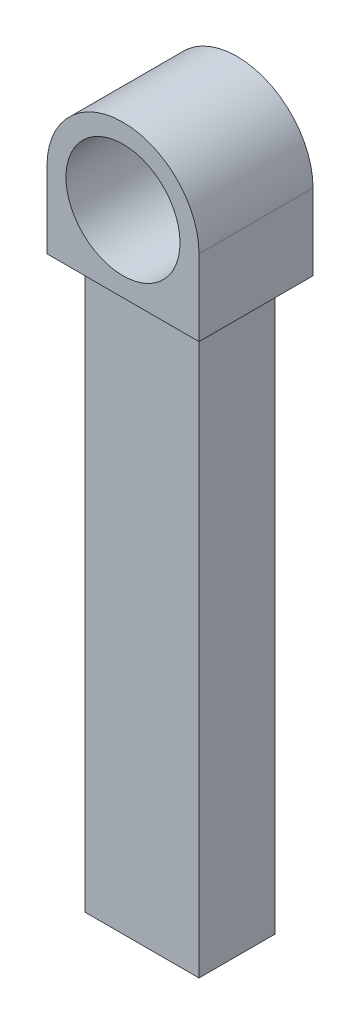
ISO-10303-21;
HEADER;
FILE_DESCRIPTION(('STEP AP214'),'2;1');
FILE_NAME('part.step','',(''),(''),'','','');
FILE_SCHEMA(('AUTOMOTIVE_DESIGN { 1 0 10303 214 1 1 1 1 }'));
ENDSEC;
DATA;
#1=APPLICATION_CONTEXT('core data for automotive mechanical design processes');
#2=APPLICATION_PROTOCOL_DEFINITION('international standard','automotive_design',2000,#1);
#3=PRODUCT_CONTEXT('',#1,'mechanical');
#4=PRODUCT('Part','Part','',(#3));
#5=PRODUCT_RELATED_PRODUCT_CATEGORY('part','',(#4));
#6=PRODUCT_DEFINITION_FORMATION('','',#4);
#7=PRODUCT_DEFINITION_CONTEXT('part definition',#1,'design');
#8=PRODUCT_DEFINITION('design','',#6,#7);
#9=PRODUCT_DEFINITION_SHAPE('','',#8);
#10=(LENGTH_UNIT() NAMED_UNIT(*) SI_UNIT(.MILLI.,.METRE.));
#11=(NAMED_UNIT(*) PLANE_ANGLE_UNIT() SI_UNIT($,.RADIAN.));
#12=(NAMED_UNIT(*) SI_UNIT($,.STERADIAN.) SOLID_ANGLE_UNIT());
#13=UNCERTAINTY_MEASURE_WITH_UNIT(LENGTH_MEASURE(1.E-05),#10,'distance_accuracy_value','');
#14=(GEOMETRIC_REPRESENTATION_CONTEXT(3) GLOBAL_UNCERTAINTY_ASSIGNED_CONTEXT((#13)) GLOBAL_UNIT_ASSIGNED_CONTEXT((#10,
#11,#12)) REPRESENTATION_CONTEXT('',''));
#15=CARTESIAN_POINT('',(0.,0.,0.));
#16=DIRECTION('',(0.,0.,1.));
#17=DIRECTION('',(1.,0.,0.));
#18=AXIS2_PLACEMENT_3D('',#15,#16,#17);
#19=CARTESIAN_POINT('',(0.,-2.,3.));
#20=DIRECTION('',(0.,1.,0.));
#21=DIRECTION('',(0.,0.,1.));
#22=AXIS2_PLACEMENT_3D('',#19,#20,#21);
#23=PLANE('',#22);
#24=DIRECTION('',(1.,0.,0.));
#25=VECTOR('',#24,1.);
#26=CARTESIAN_POINT('',(0.,-2.,0.));
#27=LINE('',#26,#25);
#28=CARTESIAN_POINT('',(-2.,-2.,0.));
#29=VERTEX_POINT('',#28);
#30=CARTESIAN_POINT('',(2.,-2.,0.));
#31=VERTEX_POINT('',#30);
#32=EDGE_CURVE('E120',#29,#31,#27,.T.);
#33=ORIENTED_EDGE('',*,*,#32,.T.);
#34=DIRECTION('',(0.,0.,-1.));
#35=VECTOR('',#34,1.);
#36=CARTESIAN_POINT('',(2.,-2.,3.));
#37=LINE('',#36,#35);
#38=CARTESIAN_POINT('',(2.,-2.,3.));
#39=VERTEX_POINT('',#38);
#40=EDGE_CURVE('E11',#39,#31,#37,.T.);
#41=ORIENTED_EDGE('',*,*,#40,.F.);
#42=DIRECTION('',(1.,0.,0.));
#43=VECTOR('',#42,1.);
#44=CARTESIAN_POINT('',(0.,-2.,3.));
#45=LINE('',#44,#43);
#46=CARTESIAN_POINT('',(-2.,-2.,3.));
#47=VERTEX_POINT('',#46);
#48=EDGE_CURVE('E129',#47,#39,#45,.T.);
#49=ORIENTED_EDGE('',*,*,#48,.F.);
#50=DIRECTION('',(0.,0.,-1.));
#51=VECTOR('',#50,1.);
#52=CARTESIAN_POINT('',(-2.,-2.,3.));
#53=LINE('',#52,#51);
#54=EDGE_CURVE('E141',#47,#29,#53,.T.);
#55=ORIENTED_EDGE('',*,*,#54,.T.);
#56=EDGE_LOOP('',(#33,#41,#49,#55));
#57=FACE_BOUND('',#56,.T.);
#58=DIRECTION('',(0.,0.,1.));
#59=VECTOR('',#58,1.);
#60=CARTESIAN_POINT('',(1.5,-2.,2.5));
#61=LINE('',#60,#59);
#62=CARTESIAN_POINT('',(1.5,-2.,0.5));
#63=VERTEX_POINT('',#62);
#64=CARTESIAN_POINT('',(1.5,-2.,2.5));
#65=VERTEX_POINT('',#64);
#66=EDGE_CURVE('E50',#63,#65,#61,.T.);
#67=ORIENTED_EDGE('',*,*,#66,.F.);
#68=DIRECTION('',(1.,0.,0.));
#69=VECTOR('',#68,1.);
#70=CARTESIAN_POINT('',(1.5,-2.,0.5));
#71=LINE('',#70,#69);
#72=CARTESIAN_POINT('',(-1.5,-2.,0.5));
#73=VERTEX_POINT('',#72);
#74=EDGE_CURVE('E54',#73,#63,#71,.T.);
#75=ORIENTED_EDGE('',*,*,#74,.F.);
#76=DIRECTION('',(0.,0.,-1.));
#77=VECTOR('',#76,1.);
#78=CARTESIAN_POINT('',(-1.5,-2.,2.5));
#79=LINE('',#78,#77);
#80=CARTESIAN_POINT('',(-1.5,-2.,2.5));
#81=VERTEX_POINT('',#80);
#82=EDGE_CURVE('E293',#81,#73,#79,.T.);
#83=ORIENTED_EDGE('',*,*,#82,.F.);
#84=DIRECTION('',(-1.,0.,0.));
#85=VECTOR('',#84,1.);
#86=CARTESIAN_POINT('',(1.5,-2.,2.5));
#87=LINE('',#86,#85);
#88=EDGE_CURVE('E299',#65,#81,#87,.T.);
#89=ORIENTED_EDGE('',*,*,#88,.F.);
#90=EDGE_LOOP('',(#67,#75,#83,#89));
#91=FACE_BOUND('',#90,.T.);
#92=ADVANCED_FACE('F36',(#57,#91),#23,.F.);
#93=CARTESIAN_POINT('',(2.,0.,3.));
#94=DIRECTION('',(-1.,0.,0.));
#95=DIRECTION('',(0.,-1.,0.));
#96=AXIS2_PLACEMENT_3D('',#93,#94,#95);
#97=PLANE('',#96);
#98=DIRECTION('',(0.,1.,0.));
#99=VECTOR('',#98,1.);
#100=CARTESIAN_POINT('',(2.,0.,0.));
#101=LINE('',#100,#99);
#102=CARTESIAN_POINT('',(2.,0.,0.));
#103=VERTEX_POINT('',#102);
#104=EDGE_CURVE('E123',#31,#103,#101,.T.);
#105=ORIENTED_EDGE('',*,*,#104,.T.);
#106=DIRECTION('',(0.,0.,-1.));
#107=VECTOR('',#106,1.);
#108=CARTESIAN_POINT('',(2.,0.,3.));
#109=LINE('',#108,#107);
#110=CARTESIAN_POINT('',(2.,0.,3.));
#111=VERTEX_POINT('',#110);
#112=EDGE_CURVE('E43',#111,#103,#109,.T.);
#113=ORIENTED_EDGE('',*,*,#112,.F.);
#114=DIRECTION('',(0.,1.,0.));
#115=VECTOR('',#114,1.);
#116=CARTESIAN_POINT('',(2.,0.,3.));
#117=LINE('',#116,#115);
#118=EDGE_CURVE('E132',#39,#111,#117,.T.);
#119=ORIENTED_EDGE('',*,*,#118,.F.);
#120=ORIENTED_EDGE('',*,*,#40,.T.);
#121=EDGE_LOOP('',(#105,#113,#119,#120));
#122=FACE_BOUND('',#121,.T.);
#123=ADVANCED_FACE('F177',(#122),#97,.F.);
#124=CARTESIAN_POINT('',(0.,0.,3.));
#125=DIRECTION('',(0.,0.,-1.));
#126=DIRECTION('',(-1.,0.,0.));
#127=AXIS2_PLACEMENT_3D('',#124,#125,#126);
#128=CYLINDRICAL_SURFACE('',#127,2.);
#129=CARTESIAN_POINT('',(0.,0.,0.));
#130=DIRECTION('',(0.,0.,1.));
#131=DIRECTION('',(1.,0.,0.));
#132=AXIS2_PLACEMENT_3D('',#129,#130,#131);
#133=CIRCLE('',#132,2.);
#134=CARTESIAN_POINT('',(-2.,0.,0.));
#135=VERTEX_POINT('',#134);
#136=EDGE_CURVE('E144',#103,#135,#133,.T.);
#137=ORIENTED_EDGE('',*,*,#136,.T.);
#138=DIRECTION('',(0.,0.,-1.));
#139=VECTOR('',#138,1.);
#140=CARTESIAN_POINT('',(-2.,0.,3.));
#141=LINE('',#140,#139);
#142=CARTESIAN_POINT('',(-2.,0.,3.));
#143=VERTEX_POINT('',#142);
#144=EDGE_CURVE('E152',#143,#135,#141,.T.);
#145=ORIENTED_EDGE('',*,*,#144,.F.);
#146=CARTESIAN_POINT('',(0.,0.,3.));
#147=DIRECTION('',(0.,0.,1.));
#148=DIRECTION('',(1.,0.,0.));
#149=AXIS2_PLACEMENT_3D('',#146,#147,#148);
#150=CIRCLE('',#149,2.);
#151=EDGE_CURVE('E135',#111,#143,#150,.T.);
#152=ORIENTED_EDGE('',*,*,#151,.F.);
#153=ORIENTED_EDGE('',*,*,#112,.T.);
#154=EDGE_LOOP('',(#137,#145,#152,#153));
#155=FACE_BOUND('',#154,.T.);
#156=ADVANCED_FACE('F159',(#155),#128,.T.);
#157=CARTESIAN_POINT('',(-2.,0.,3.));
#158=DIRECTION('',(1.,0.,0.));
#159=DIRECTION('',(0.,1.,0.));
#160=AXIS2_PLACEMENT_3D('',#157,#158,#159);
#161=PLANE('',#160);
#162=DIRECTION('',(0.,-1.,0.));
#163=VECTOR('',#162,1.);
#164=CARTESIAN_POINT('',(-2.,0.,0.));
#165=LINE('',#164,#163);
#166=EDGE_CURVE('E146',#135,#29,#165,.T.);
#167=ORIENTED_EDGE('',*,*,#166,.T.);
#168=ORIENTED_EDGE('',*,*,#54,.F.);
#169=DIRECTION('',(0.,-1.,0.));
#170=VECTOR('',#169,1.);
#171=CARTESIAN_POINT('',(-2.,0.,3.));
#172=LINE('',#171,#170);
#173=EDGE_CURVE('E137',#143,#47,#172,.T.);
#174=ORIENTED_EDGE('',*,*,#173,.F.);
#175=ORIENTED_EDGE('',*,*,#144,.T.);
#176=EDGE_LOOP('',(#167,#168,#174,#175));
#177=FACE_BOUND('',#176,.T.);
#178=ADVANCED_FACE('F169',(#177),#161,.F.);
#179=CARTESIAN_POINT('',(0.,0.,3.));
#180=DIRECTION('',(0.,0.,-1.));
#181=DIRECTION('',(-1.,0.,0.));
#182=AXIS2_PLACEMENT_3D('',#179,#180,#181);
#183=CYLINDRICAL_SURFACE('',#182,1.5);
#184=CARTESIAN_POINT('',(0.,0.,3.));
#185=DIRECTION('',(0.,0.,1.));
#186=DIRECTION('',(1.,0.,0.));
#187=AXIS2_PLACEMENT_3D('',#184,#185,#186);
#188=CIRCLE('',#187,1.5);
#189=CARTESIAN_POINT('',(1.5,0.,3.));
#190=VERTEX_POINT('',#189);
#191=EDGE_CURVE('E139',#190,#190,#188,.T.);
#192=ORIENTED_EDGE('',*,*,#191,.T.);
#193=EDGE_LOOP('',(#192));
#194=FACE_BOUND('',#193,.T.);
#195=CARTESIAN_POINT('',(0.,0.,0.));
#196=DIRECTION('',(0.,0.,1.));
#197=DIRECTION('',(1.,0.,0.));
#198=AXIS2_PLACEMENT_3D('',#195,#196,#197);
#199=CIRCLE('',#198,1.5);
#200=CARTESIAN_POINT('',(1.5,0.,0.));
#201=VERTEX_POINT('',#200);
#202=EDGE_CURVE('E133',#201,#201,#199,.T.);
#203=ORIENTED_EDGE('',*,*,#202,.F.);
#204=EDGE_LOOP('',(#203));
#205=FACE_BOUND('',#204,.T.);
#206=ADVANCED_FACE('F187',(#194,#205),#183,.F.);
#207=CARTESIAN_POINT('',(0.,0.,3.));
#208=DIRECTION('',(0.,0.,1.));
#209=DIRECTION('',(1.,0.,0.));
#210=AXIS2_PLACEMENT_3D('',#207,#208,#209);
#211=PLANE('',#210);
#212=ORIENTED_EDGE('',*,*,#48,.T.);
#213=ORIENTED_EDGE('',*,*,#118,.T.);
#214=ORIENTED_EDGE('',*,*,#151,.T.);
#215=ORIENTED_EDGE('',*,*,#173,.T.);
#216=EDGE_LOOP('',(#212,#213,#214,#215));
#217=FACE_BOUND('',#216,.T.);
#218=ORIENTED_EDGE('',*,*,#191,.F.);
#219=EDGE_LOOP('',(#218));
#220=FACE_BOUND('',#219,.T.);
#221=ADVANCED_FACE('F175',(#217,#220),#211,.T.);
#222=CARTESIAN_POINT('',(0.,0.,0.));
#223=DIRECTION('',(0.,0.,1.));
#224=DIRECTION('',(1.,0.,0.));
#225=AXIS2_PLACEMENT_3D('',#222,#223,#224);
#226=PLANE('',#225);
#227=ORIENTED_EDGE('',*,*,#32,.F.);
#228=ORIENTED_EDGE('',*,*,#166,.F.);
#229=ORIENTED_EDGE('',*,*,#136,.F.);
#230=ORIENTED_EDGE('',*,*,#104,.F.);
#231=EDGE_LOOP('',(#227,#228,#229,#230));
#232=FACE_BOUND('',#231,.T.);
#233=ORIENTED_EDGE('',*,*,#202,.T.);
#234=EDGE_LOOP('',(#233));
#235=FACE_BOUND('',#234,.T.);
#236=ADVANCED_FACE('F165',(#232,#235),#226,.F.);
#237=CARTESIAN_POINT('',(1.5,-17.,2.5));
#238=DIRECTION('',(-1.,0.,0.));
#239=DIRECTION('',(0.,0.,1.));
#240=AXIS2_PLACEMENT_3D('',#237,#238,#239);
#241=PLANE('',#240);
#242=ORIENTED_EDGE('',*,*,#66,.T.);
#243=DIRECTION('',(0.,1.,0.));
#244=VECTOR('',#243,1.);
#245=CARTESIAN_POINT('',(1.5,-17.,2.5));
#246=LINE('',#245,#244);
#247=CARTESIAN_POINT('',(1.5,-17.,2.5));
#248=VERTEX_POINT('',#247);
#249=EDGE_CURVE('E103',#248,#65,#246,.T.);
#250=ORIENTED_EDGE('',*,*,#249,.F.);
#251=DIRECTION('',(0.,0.,1.));
#252=VECTOR('',#251,1.);
#253=CARTESIAN_POINT('',(1.5,-17.,2.5));
#254=LINE('',#253,#252);
#255=CARTESIAN_POINT('',(1.5,-17.,0.5));
#256=VERTEX_POINT('',#255);
#257=EDGE_CURVE('E109',#256,#248,#254,.T.);
#258=ORIENTED_EDGE('',*,*,#257,.F.);
#259=DIRECTION('',(0.,1.,0.));
#260=VECTOR('',#259,1.);
#261=CARTESIAN_POINT('',(1.5,-17.,0.5));
#262=LINE('',#261,#260);
#263=EDGE_CURVE('E291',#256,#63,#262,.T.);
#264=ORIENTED_EDGE('',*,*,#263,.T.);
#265=EDGE_LOOP('',(#242,#250,#258,#264));
#266=FACE_BOUND('',#265,.T.);
#267=ADVANCED_FACE('F119',(#266),#241,.F.);
#268=CARTESIAN_POINT('',(1.5,-17.,2.5));
#269=DIRECTION('',(0.,0.,-1.));
#270=DIRECTION('',(-1.,0.,0.));
#271=AXIS2_PLACEMENT_3D('',#268,#269,#270);
#272=PLANE('',#271);
#273=ORIENTED_EDGE('',*,*,#88,.T.);
#274=DIRECTION('',(0.,1.,0.));
#275=VECTOR('',#274,1.);
#276=CARTESIAN_POINT('',(-1.5,-17.,2.5));
#277=LINE('',#276,#275);
#278=CARTESIAN_POINT('',(-1.5,-17.,2.5));
#279=VERTEX_POINT('',#278);
#280=EDGE_CURVE('E105',#279,#81,#277,.T.);
#281=ORIENTED_EDGE('',*,*,#280,.F.);
#282=DIRECTION('',(-1.,0.,0.));
#283=VECTOR('',#282,1.);
#284=CARTESIAN_POINT('',(1.5,-17.,2.5));
#285=LINE('',#284,#283);
#286=EDGE_CURVE('E98',#248,#279,#285,.T.);
#287=ORIENTED_EDGE('',*,*,#286,.F.);
#288=ORIENTED_EDGE('',*,*,#249,.T.);
#289=EDGE_LOOP('',(#273,#281,#287,#288));
#290=FACE_BOUND('',#289,.T.);
#291=ADVANCED_FACE('F101',(#290),#272,.F.);
#292=CARTESIAN_POINT('',(-1.5,-17.,2.5));
#293=DIRECTION('',(1.,0.,0.));
#294=DIRECTION('',(0.,0.,-1.));
#295=AXIS2_PLACEMENT_3D('',#292,#293,#294);
#296=PLANE('',#295);
#297=ORIENTED_EDGE('',*,*,#82,.T.);
#298=DIRECTION('',(0.,1.,0.));
#299=VECTOR('',#298,1.);
#300=CARTESIAN_POINT('',(-1.5,-17.,0.5));
#301=LINE('',#300,#299);
#302=CARTESIAN_POINT('',(-1.5,-17.,0.5));
#303=VERTEX_POINT('',#302);
#304=EDGE_CURVE('E125',#303,#73,#301,.T.);
#305=ORIENTED_EDGE('',*,*,#304,.F.);
#306=DIRECTION('',(0.,0.,-1.));
#307=VECTOR('',#306,1.);
#308=CARTESIAN_POINT('',(-1.5,-17.,2.5));
#309=LINE('',#308,#307);
#310=EDGE_CURVE('E108',#279,#303,#309,.T.);
#311=ORIENTED_EDGE('',*,*,#310,.F.);
#312=ORIENTED_EDGE('',*,*,#280,.T.);
#313=EDGE_LOOP('',(#297,#305,#311,#312));
#314=FACE_BOUND('',#313,.T.);
#315=ADVANCED_FACE('F199',(#314),#296,.F.);
#316=CARTESIAN_POINT('',(1.5,-17.,0.5));
#317=DIRECTION('',(0.,0.,1.));
#318=DIRECTION('',(1.,0.,0.));
#319=AXIS2_PLACEMENT_3D('',#316,#317,#318);
#320=PLANE('',#319);
#321=ORIENTED_EDGE('',*,*,#74,.T.);
#322=ORIENTED_EDGE('',*,*,#263,.F.);
#323=DIRECTION('',(1.,0.,0.));
#324=VECTOR('',#323,1.);
#325=CARTESIAN_POINT('',(1.5,-17.,0.5));
#326=LINE('',#325,#324);
#327=EDGE_CURVE('E114',#303,#256,#326,.T.);
#328=ORIENTED_EDGE('',*,*,#327,.F.);
#329=ORIENTED_EDGE('',*,*,#304,.T.);
#330=EDGE_LOOP('',(#321,#322,#328,#329));
#331=FACE_BOUND('',#330,.T.);
#332=ADVANCED_FACE('F202',(#331),#320,.F.);
#333=CARTESIAN_POINT('',(0.,-17.,0.));
#334=DIRECTION('',(0.,1.,0.));
#335=DIRECTION('',(0.,0.,1.));
#336=AXIS2_PLACEMENT_3D('',#333,#334,#335);
#337=PLANE('',#336);
#338=ORIENTED_EDGE('',*,*,#257,.T.);
#339=ORIENTED_EDGE('',*,*,#286,.T.);
#340=ORIENTED_EDGE('',*,*,#310,.T.);
#341=ORIENTED_EDGE('',*,*,#327,.T.);
#342=EDGE_LOOP('',(#338,#339,#340,#341));
#343=FACE_BOUND('',#342,.T.);
#344=ADVANCED_FACE('F112',(#343),#337,.F.);
#345=CLOSED_SHELL('',(#92,#123,#156,#178,#206,#221,#236,#267,#291,#315,#332,#344));
#346=MANIFOLD_SOLID_BREP('B2',#345);
#347=ADVANCED_BREP_SHAPE_REPRESENTATION('',(#18,#346),#14);
#348=SHAPE_DEFINITION_REPRESENTATION(#9,#347);
ENDSEC;
END-ISO-10303-21;
